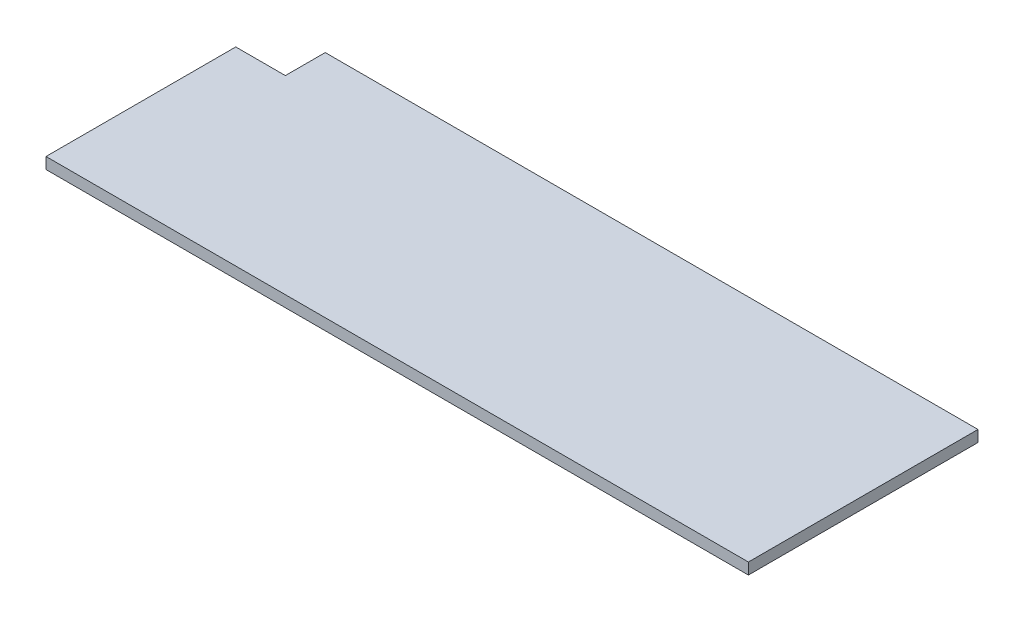
ISO-10303-21;
HEADER;
FILE_DESCRIPTION(('STEP AP214'),'2;1');
FILE_NAME('part.step','',(''),(''),'','','');
FILE_SCHEMA(('AUTOMOTIVE_DESIGN { 1 0 10303 214 1 1 1 1 }'));
ENDSEC;
DATA;
#1=APPLICATION_CONTEXT('core data for automotive mechanical design processes');
#2=APPLICATION_PROTOCOL_DEFINITION('international standard','automotive_design',2000,#1);
#3=PRODUCT_CONTEXT('',#1,'mechanical');
#4=PRODUCT('Part','Part','',(#3));
#5=PRODUCT_RELATED_PRODUCT_CATEGORY('part','',(#4));
#6=PRODUCT_DEFINITION_FORMATION('','',#4);
#7=PRODUCT_DEFINITION_CONTEXT('part definition',#1,'design');
#8=PRODUCT_DEFINITION('design','',#6,#7);
#9=PRODUCT_DEFINITION_SHAPE('','',#8);
#10=(LENGTH_UNIT() NAMED_UNIT(*) SI_UNIT(.MILLI.,.METRE.));
#11=(NAMED_UNIT(*) PLANE_ANGLE_UNIT() SI_UNIT($,.RADIAN.));
#12=(NAMED_UNIT(*) SI_UNIT($,.STERADIAN.) SOLID_ANGLE_UNIT());
#13=UNCERTAINTY_MEASURE_WITH_UNIT(LENGTH_MEASURE(1.E-05),#10,'distance_accuracy_value','');
#14=(GEOMETRIC_REPRESENTATION_CONTEXT(3) GLOBAL_UNCERTAINTY_ASSIGNED_CONTEXT((#13)) GLOBAL_UNIT_ASSIGNED_CONTEXT((#10,
#11,#12)) REPRESENTATION_CONTEXT('',''));
#15=CARTESIAN_POINT('',(0.,0.,0.));
#16=DIRECTION('',(0.,0.,1.));
#17=DIRECTION('',(1.,0.,0.));
#18=AXIS2_PLACEMENT_3D('',#15,#16,#17);
#19=CARTESIAN_POINT('',(165.65,2.67,0.));
#20=DIRECTION('',(0.,0.,-1.));
#21=DIRECTION('',(-1.,0.,0.));
#22=AXIS2_PLACEMENT_3D('',#19,#20,#21);
#23=PLANE('',#22);
#24=DIRECTION('',(1.,0.,0.));
#25=VECTOR('',#24,1.);
#26=CARTESIAN_POINT('',(165.65,0.,0.));
#27=LINE('',#26,#25);
#28=CARTESIAN_POINT('',(0.,0.,0.));
#29=VERTEX_POINT('',#28);
#30=CARTESIAN_POINT('',(165.65,0.,0.));
#31=VERTEX_POINT('',#30);
#32=EDGE_CURVE('E120',#29,#31,#27,.T.);
#33=ORIENTED_EDGE('',*,*,#32,.T.);
#34=DIRECTION('',(0.,-1.,0.));
#35=VECTOR('',#34,1.);
#36=CARTESIAN_POINT('',(165.65,2.67,0.));
#37=LINE('',#36,#35);
#38=CARTESIAN_POINT('',(165.65,2.67,0.));
#39=VERTEX_POINT('',#38);
#40=EDGE_CURVE('E11',#39,#31,#37,.T.);
#41=ORIENTED_EDGE('',*,*,#40,.F.);
#42=DIRECTION('',(1.,0.,0.));
#43=VECTOR('',#42,1.);
#44=CARTESIAN_POINT('',(165.65,2.67,0.));
#45=LINE('',#44,#43);
#46=CARTESIAN_POINT('',(0.,2.67,0.));
#47=VERTEX_POINT('',#46);
#48=EDGE_CURVE('E130',#47,#39,#45,.T.);
#49=ORIENTED_EDGE('',*,*,#48,.F.);
#50=DIRECTION('',(0.,-1.,0.));
#51=VECTOR('',#50,1.);
#52=CARTESIAN_POINT('',(0.,2.67,0.));
#53=LINE('',#52,#51);
#54=EDGE_CURVE('E116',#47,#29,#53,.T.);
#55=ORIENTED_EDGE('',*,*,#54,.T.);
#56=EDGE_LOOP('',(#33,#41,#49,#55));
#57=FACE_BOUND('',#56,.T.);
#58=ADVANCED_FACE('F36',(#57),#23,.F.);
#59=CARTESIAN_POINT('',(165.65,2.67,-54.15));
#60=DIRECTION('',(-1.,0.,0.));
#61=DIRECTION('',(0.,0.,1.));
#62=AXIS2_PLACEMENT_3D('',#59,#60,#61);
#63=PLANE('',#62);
#64=DIRECTION('',(0.,0.,-1.));
#65=VECTOR('',#64,1.);
#66=CARTESIAN_POINT('',(165.65,0.,-54.15));
#67=LINE('',#66,#65);
#68=CARTESIAN_POINT('',(165.65,0.,-54.15));
#69=VERTEX_POINT('',#68);
#70=EDGE_CURVE('E123',#31,#69,#67,.T.);
#71=ORIENTED_EDGE('',*,*,#70,.T.);
#72=DIRECTION('',(0.,-1.,0.));
#73=VECTOR('',#72,1.);
#74=CARTESIAN_POINT('',(165.65,2.67,-54.15));
#75=LINE('',#74,#73);
#76=CARTESIAN_POINT('',(165.65,2.67,-54.15));
#77=VERTEX_POINT('',#76);
#78=EDGE_CURVE('E44',#77,#69,#75,.T.);
#79=ORIENTED_EDGE('',*,*,#78,.F.);
#80=DIRECTION('',(0.,0.,-1.));
#81=VECTOR('',#80,1.);
#82=CARTESIAN_POINT('',(165.65,2.67,-54.15));
#83=LINE('',#82,#81);
#84=EDGE_CURVE('E89',#39,#77,#83,.T.);
#85=ORIENTED_EDGE('',*,*,#84,.F.);
#86=ORIENTED_EDGE('',*,*,#40,.T.);
#87=EDGE_LOOP('',(#71,#79,#85,#86));
#88=FACE_BOUND('',#87,.T.);
#89=ADVANCED_FACE('F154',(#88),#63,.F.);
#90=CARTESIAN_POINT('',(11.7,2.67,-54.15));
#91=DIRECTION('',(0.,0.,1.));
#92=DIRECTION('',(1.,0.,0.));
#93=AXIS2_PLACEMENT_3D('',#90,#91,#92);
#94=PLANE('',#93);
#95=DIRECTION('',(-1.,0.,0.));
#96=VECTOR('',#95,1.);
#97=CARTESIAN_POINT('',(11.7,0.,-54.15));
#98=LINE('',#97,#96);
#99=CARTESIAN_POINT('',(11.7,0.,-54.15));
#100=VERTEX_POINT('',#99);
#101=EDGE_CURVE('E125',#69,#100,#98,.T.);
#102=ORIENTED_EDGE('',*,*,#101,.T.);
#103=DIRECTION('',(0.,-1.,0.));
#104=VECTOR('',#103,1.);
#105=CARTESIAN_POINT('',(11.7,2.67,-54.15));
#106=LINE('',#105,#104);
#107=CARTESIAN_POINT('',(11.7,2.67,-54.15));
#108=VERTEX_POINT('',#107);
#109=EDGE_CURVE('E111',#108,#100,#106,.T.);
#110=ORIENTED_EDGE('',*,*,#109,.F.);
#111=DIRECTION('',(-1.,0.,0.));
#112=VECTOR('',#111,1.);
#113=CARTESIAN_POINT('',(11.7,2.67,-54.15));
#114=LINE('',#113,#112);
#115=EDGE_CURVE('E102',#77,#108,#114,.T.);
#116=ORIENTED_EDGE('',*,*,#115,.F.);
#117=ORIENTED_EDGE('',*,*,#78,.T.);
#118=EDGE_LOOP('',(#102,#110,#116,#117));
#119=FACE_BOUND('',#118,.T.);
#120=ADVANCED_FACE('F136',(#119),#94,.F.);
#121=CARTESIAN_POINT('',(11.7,2.67,-44.75));
#122=DIRECTION('',(1.,0.,0.));
#123=DIRECTION('',(0.,0.,-1.));
#124=AXIS2_PLACEMENT_3D('',#121,#122,#123);
#125=PLANE('',#124);
#126=DIRECTION('',(0.,0.,1.));
#127=VECTOR('',#126,1.);
#128=CARTESIAN_POINT('',(11.7,0.,-44.75));
#129=LINE('',#128,#127);
#130=CARTESIAN_POINT('',(11.7,0.,-44.75));
#131=VERTEX_POINT('',#130);
#132=EDGE_CURVE('E110',#100,#131,#129,.T.);
#133=ORIENTED_EDGE('',*,*,#132,.T.);
#134=DIRECTION('',(0.,-1.,0.));
#135=VECTOR('',#134,1.);
#136=CARTESIAN_POINT('',(11.7,2.67,-44.75));
#137=LINE('',#136,#135);
#138=CARTESIAN_POINT('',(11.7,2.67,-44.75));
#139=VERTEX_POINT('',#138);
#140=EDGE_CURVE('E107',#139,#131,#137,.T.);
#141=ORIENTED_EDGE('',*,*,#140,.F.);
#142=DIRECTION('',(0.,0.,1.));
#143=VECTOR('',#142,1.);
#144=CARTESIAN_POINT('',(11.7,2.67,-44.75));
#145=LINE('',#144,#143);
#146=EDGE_CURVE('E96',#108,#139,#145,.T.);
#147=ORIENTED_EDGE('',*,*,#146,.F.);
#148=ORIENTED_EDGE('',*,*,#109,.T.);
#149=EDGE_LOOP('',(#133,#141,#147,#148));
#150=FACE_BOUND('',#149,.T.);
#151=ADVANCED_FACE('F108',(#150),#125,.F.);
#152=CARTESIAN_POINT('',(0.,2.67,-44.75));
#153=DIRECTION('',(0.,0.,1.));
#154=DIRECTION('',(1.,0.,0.));
#155=AXIS2_PLACEMENT_3D('',#152,#153,#154);
#156=PLANE('',#155);
#157=DIRECTION('',(-1.,0.,0.));
#158=VECTOR('',#157,1.);
#159=CARTESIAN_POINT('',(0.,0.,-44.75));
#160=LINE('',#159,#158);
#161=CARTESIAN_POINT('',(0.,0.,-44.75));
#162=VERTEX_POINT('',#161);
#163=EDGE_CURVE('E75',#131,#162,#160,.T.);
#164=ORIENTED_EDGE('',*,*,#163,.T.);
#165=DIRECTION('',(0.,-1.,0.));
#166=VECTOR('',#165,1.);
#167=CARTESIAN_POINT('',(0.,2.67,-44.75));
#168=LINE('',#167,#166);
#169=CARTESIAN_POINT('',(0.,2.67,-44.75));
#170=VERTEX_POINT('',#169);
#171=EDGE_CURVE('E112',#170,#162,#168,.T.);
#172=ORIENTED_EDGE('',*,*,#171,.F.);
#173=DIRECTION('',(-1.,0.,0.));
#174=VECTOR('',#173,1.);
#175=CARTESIAN_POINT('',(0.,2.67,-44.75));
#176=LINE('',#175,#174);
#177=EDGE_CURVE('E100',#139,#170,#176,.T.);
#178=ORIENTED_EDGE('',*,*,#177,.F.);
#179=ORIENTED_EDGE('',*,*,#140,.T.);
#180=EDGE_LOOP('',(#164,#172,#178,#179));
#181=FACE_BOUND('',#180,.T.);
#182=ADVANCED_FACE('F114',(#181),#156,.F.);
#183=CARTESIAN_POINT('',(0.,2.67,0.));
#184=DIRECTION('',(1.,0.,0.));
#185=DIRECTION('',(0.,0.,-1.));
#186=AXIS2_PLACEMENT_3D('',#183,#184,#185);
#187=PLANE('',#186);
#188=DIRECTION('',(0.,0.,1.));
#189=VECTOR('',#188,1.);
#190=CARTESIAN_POINT('',(0.,0.,0.));
#191=LINE('',#190,#189);
#192=EDGE_CURVE('E81',#162,#29,#191,.T.);
#193=ORIENTED_EDGE('',*,*,#192,.T.);
#194=ORIENTED_EDGE('',*,*,#54,.F.);
#195=DIRECTION('',(0.,0.,1.));
#196=VECTOR('',#195,1.);
#197=CARTESIAN_POINT('',(0.,2.67,0.));
#198=LINE('',#197,#196);
#199=EDGE_CURVE('E52',#170,#47,#198,.T.);
#200=ORIENTED_EDGE('',*,*,#199,.F.);
#201=ORIENTED_EDGE('',*,*,#171,.T.);
#202=EDGE_LOOP('',(#193,#194,#200,#201));
#203=FACE_BOUND('',#202,.T.);
#204=ADVANCED_FACE('F143',(#203),#187,.F.);
#205=CARTESIAN_POINT('',(0.,2.67,0.));
#206=DIRECTION('',(0.,-1.,0.));
#207=DIRECTION('',(0.,0.,-1.));
#208=AXIS2_PLACEMENT_3D('',#205,#206,#207);
#209=PLANE('',#208);
#210=ORIENTED_EDGE('',*,*,#48,.T.);
#211=ORIENTED_EDGE('',*,*,#84,.T.);
#212=ORIENTED_EDGE('',*,*,#115,.T.);
#213=ORIENTED_EDGE('',*,*,#146,.T.);
#214=ORIENTED_EDGE('',*,*,#177,.T.);
#215=ORIENTED_EDGE('',*,*,#199,.T.);
#216=EDGE_LOOP('',(#210,#211,#212,#213,#214,#215));
#217=FACE_BOUND('',#216,.T.);
#218=ADVANCED_FACE('F98',(#217),#209,.F.);
#219=CARTESIAN_POINT('',(0.,0.,0.));
#220=DIRECTION('',(0.,-1.,0.));
#221=DIRECTION('',(0.,0.,-1.));
#222=AXIS2_PLACEMENT_3D('',#219,#220,#221);
#223=PLANE('',#222);
#224=ORIENTED_EDGE('',*,*,#32,.F.);
#225=ORIENTED_EDGE('',*,*,#192,.F.);
#226=ORIENTED_EDGE('',*,*,#163,.F.);
#227=ORIENTED_EDGE('',*,*,#132,.F.);
#228=ORIENTED_EDGE('',*,*,#101,.F.);
#229=ORIENTED_EDGE('',*,*,#70,.F.);
#230=EDGE_LOOP('',(#224,#225,#226,#227,#228,#229));
#231=FACE_BOUND('',#230,.T.);
#232=ADVANCED_FACE('F139',(#231),#223,.T.);
#233=CLOSED_SHELL('',(#58,#89,#120,#151,#182,#204,#218,#232));
#234=MANIFOLD_SOLID_BREP('B2',#233);
#235=ADVANCED_BREP_SHAPE_REPRESENTATION('',(#18,#234),#14);
#236=SHAPE_DEFINITION_REPRESENTATION(#9,#235);
ENDSEC;
END-ISO-10303-21;
